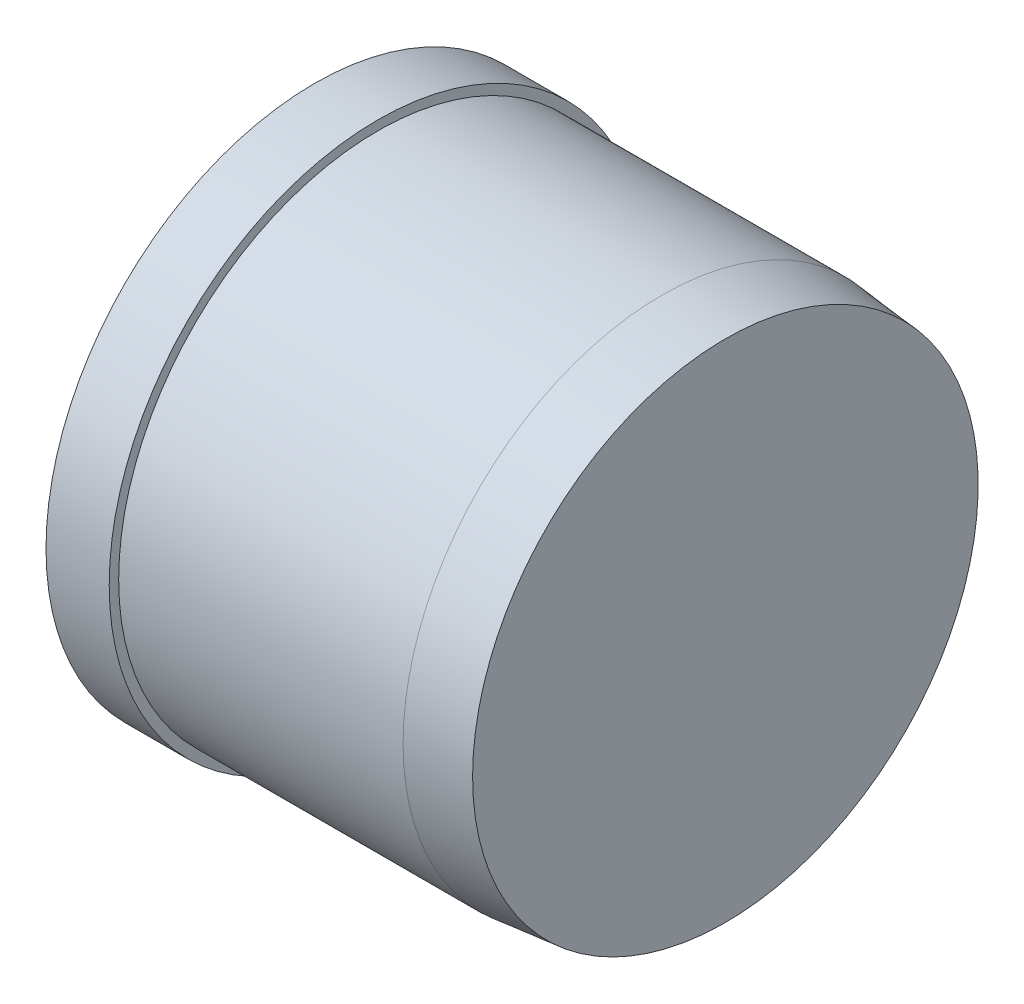
ISO-10303-21;
HEADER;
FILE_DESCRIPTION(('STEP AP214'),'2;1');
FILE_NAME('part.step','',(''),(''),'','','');
FILE_SCHEMA(('AUTOMOTIVE_DESIGN { 1 0 10303 214 1 1 1 1 }'));
ENDSEC;
DATA;
#1=APPLICATION_CONTEXT('core data for automotive mechanical design processes');
#2=APPLICATION_PROTOCOL_DEFINITION('international standard','automotive_design',2000,#1);
#3=PRODUCT_CONTEXT('',#1,'mechanical');
#4=PRODUCT('Part','Part','',(#3));
#5=PRODUCT_RELATED_PRODUCT_CATEGORY('part','',(#4));
#6=PRODUCT_DEFINITION_FORMATION('','',#4);
#7=PRODUCT_DEFINITION_CONTEXT('part definition',#1,'design');
#8=PRODUCT_DEFINITION('design','',#6,#7);
#9=PRODUCT_DEFINITION_SHAPE('','',#8);
#10=(LENGTH_UNIT() NAMED_UNIT(*) SI_UNIT(.MILLI.,.METRE.));
#11=(NAMED_UNIT(*) PLANE_ANGLE_UNIT() SI_UNIT($,.RADIAN.));
#12=(NAMED_UNIT(*) SI_UNIT($,.STERADIAN.) SOLID_ANGLE_UNIT());
#13=UNCERTAINTY_MEASURE_WITH_UNIT(LENGTH_MEASURE(1.E-05),#10,'distance_accuracy_value','');
#14=(GEOMETRIC_REPRESENTATION_CONTEXT(3) GLOBAL_UNCERTAINTY_ASSIGNED_CONTEXT((#13)) GLOBAL_UNIT_ASSIGNED_CONTEXT((#10,
#11,#12)) REPRESENTATION_CONTEXT('',''));
#15=CARTESIAN_POINT('',(0.,0.,0.));
#16=DIRECTION('',(0.,0.,1.));
#17=DIRECTION('',(1.,0.,0.));
#18=AXIS2_PLACEMENT_3D('',#15,#16,#17);
#19=CARTESIAN_POINT('',(65.,0.,0.));
#20=DIRECTION('',(-1.,0.,0.));
#21=DIRECTION('',(0.,0.,1.));
#22=AXIS2_PLACEMENT_3D('',#19,#20,#21);
#23=PLANE('',#22);
#24=CARTESIAN_POINT('',(65.,0.,0.));
#25=DIRECTION('',(-1.,0.,0.));
#26=DIRECTION('',(0.,0.,1.));
#27=AXIS2_PLACEMENT_3D('',#24,#25,#26);
#28=CIRCLE('',#27,40.);
#29=CARTESIAN_POINT('',(65.,0.,40.));
#30=VERTEX_POINT('',#29);
#31=EDGE_CURVE('E10',#30,#30,#28,.T.);
#32=ORIENTED_EDGE('',*,*,#31,.F.);
#33=EDGE_LOOP('',(#32));
#34=FACE_BOUND('',#33,.T.);
#35=ADVANCED_FACE('F34',(#34),#23,.F.);
#36=CARTESIAN_POINT('',(65.,0.,0.));
#37=DIRECTION('',(-1.,0.,0.));
#38=DIRECTION('',(0.,0.,1.));
#39=AXIS2_PLACEMENT_3D('',#36,#37,#38);
#40=CONICAL_SURFACE('',#39,40.,0.0996686524911628);
#41=CARTESIAN_POINT('',(55.,0.,0.));
#42=DIRECTION('',(-1.,0.,0.));
#43=DIRECTION('',(0.,0.,1.));
#44=AXIS2_PLACEMENT_3D('',#41,#42,#43);
#45=CIRCLE('',#44,41.);
#46=CARTESIAN_POINT('',(55.,0.,41.));
#47=VERTEX_POINT('',#46);
#48=EDGE_CURVE('E40',#47,#47,#45,.T.);
#49=ORIENTED_EDGE('',*,*,#48,.F.);
#50=EDGE_LOOP('',(#49));
#51=FACE_BOUND('',#50,.T.);
#52=ORIENTED_EDGE('',*,*,#31,.T.);
#53=EDGE_LOOP('',(#52));
#54=FACE_BOUND('',#53,.T.);
#55=ADVANCED_FACE('F73',(#51,#54),#40,.T.);
#56=CARTESIAN_POINT('',(0.,0.,0.));
#57=DIRECTION('',(-1.,0.,0.));
#58=DIRECTION('',(0.,0.,1.));
#59=AXIS2_PLACEMENT_3D('',#56,#57,#58);
#60=CYLINDRICAL_SURFACE('',#59,41.);
#61=CARTESIAN_POINT('',(10.,0.,0.));
#62=DIRECTION('',(-1.,0.,0.));
#63=DIRECTION('',(0.,0.,1.));
#64=AXIS2_PLACEMENT_3D('',#61,#62,#63);
#65=CIRCLE('',#64,41.);
#66=CARTESIAN_POINT('',(10.,0.,41.));
#67=VERTEX_POINT('',#66);
#68=EDGE_CURVE('E44',#67,#67,#65,.T.);
#69=ORIENTED_EDGE('',*,*,#68,.F.);
#70=EDGE_LOOP('',(#69));
#71=FACE_BOUND('',#70,.T.);
#72=ORIENTED_EDGE('',*,*,#48,.T.);
#73=EDGE_LOOP('',(#72));
#74=FACE_BOUND('',#73,.T.);
#75=ADVANCED_FACE('F68',(#71,#74),#60,.T.);
#76=CARTESIAN_POINT('',(10.,41.,0.));
#77=DIRECTION('',(-1.,0.,0.));
#78=DIRECTION('',(0.,0.,1.));
#79=AXIS2_PLACEMENT_3D('',#76,#77,#78);
#80=PLANE('',#79);
#81=CARTESIAN_POINT('',(10.,0.,0.));
#82=DIRECTION('',(-1.,0.,0.));
#83=DIRECTION('',(0.,0.,1.));
#84=AXIS2_PLACEMENT_3D('',#81,#82,#83);
#85=CIRCLE('',#84,42.5);
#86=CARTESIAN_POINT('',(10.,0.,42.5));
#87=VERTEX_POINT('',#86);
#88=EDGE_CURVE('E48',#87,#87,#85,.T.);
#89=ORIENTED_EDGE('',*,*,#88,.F.);
#90=EDGE_LOOP('',(#89));
#91=FACE_BOUND('',#90,.T.);
#92=ORIENTED_EDGE('',*,*,#68,.T.);
#93=EDGE_LOOP('',(#92));
#94=FACE_BOUND('',#93,.T.);
#95=ADVANCED_FACE('F62',(#91,#94),#80,.F.);
#96=CARTESIAN_POINT('',(0.,0.,0.));
#97=DIRECTION('',(-1.,0.,0.));
#98=DIRECTION('',(0.,0.,1.));
#99=AXIS2_PLACEMENT_3D('',#96,#97,#98);
#100=CYLINDRICAL_SURFACE('',#99,42.5);
#101=CARTESIAN_POINT('',(0.,0.,0.));
#102=DIRECTION('',(-1.,0.,0.));
#103=DIRECTION('',(0.,0.,1.));
#104=AXIS2_PLACEMENT_3D('',#101,#102,#103);
#105=CIRCLE('',#104,42.5);
#106=CARTESIAN_POINT('',(0.,0.,42.5));
#107=VERTEX_POINT('',#106);
#108=EDGE_CURVE('E53',#107,#107,#105,.T.);
#109=ORIENTED_EDGE('',*,*,#108,.F.);
#110=EDGE_LOOP('',(#109));
#111=FACE_BOUND('',#110,.T.);
#112=ORIENTED_EDGE('',*,*,#88,.T.);
#113=EDGE_LOOP('',(#112));
#114=FACE_BOUND('',#113,.T.);
#115=ADVANCED_FACE('F59',(#111,#114),#100,.T.);
#116=CARTESIAN_POINT('',(0.,42.5,0.));
#117=DIRECTION('',(1.,0.,0.));
#118=DIRECTION('',(0.,0.,-1.));
#119=AXIS2_PLACEMENT_3D('',#116,#117,#118);
#120=PLANE('',#119);
#121=ORIENTED_EDGE('',*,*,#108,.T.);
#122=EDGE_LOOP('',(#121));
#123=FACE_BOUND('',#122,.T.);
#124=ADVANCED_FACE('F57',(#123),#120,.F.);
#125=CLOSED_SHELL('',(#35,#55,#75,#95,#115,#124));
#126=MANIFOLD_SOLID_BREP('B2',#125);
#127=ADVANCED_BREP_SHAPE_REPRESENTATION('',(#18,#126),#14);
#128=SHAPE_DEFINITION_REPRESENTATION(#9,#127);
ENDSEC;
END-ISO-10303-21;
